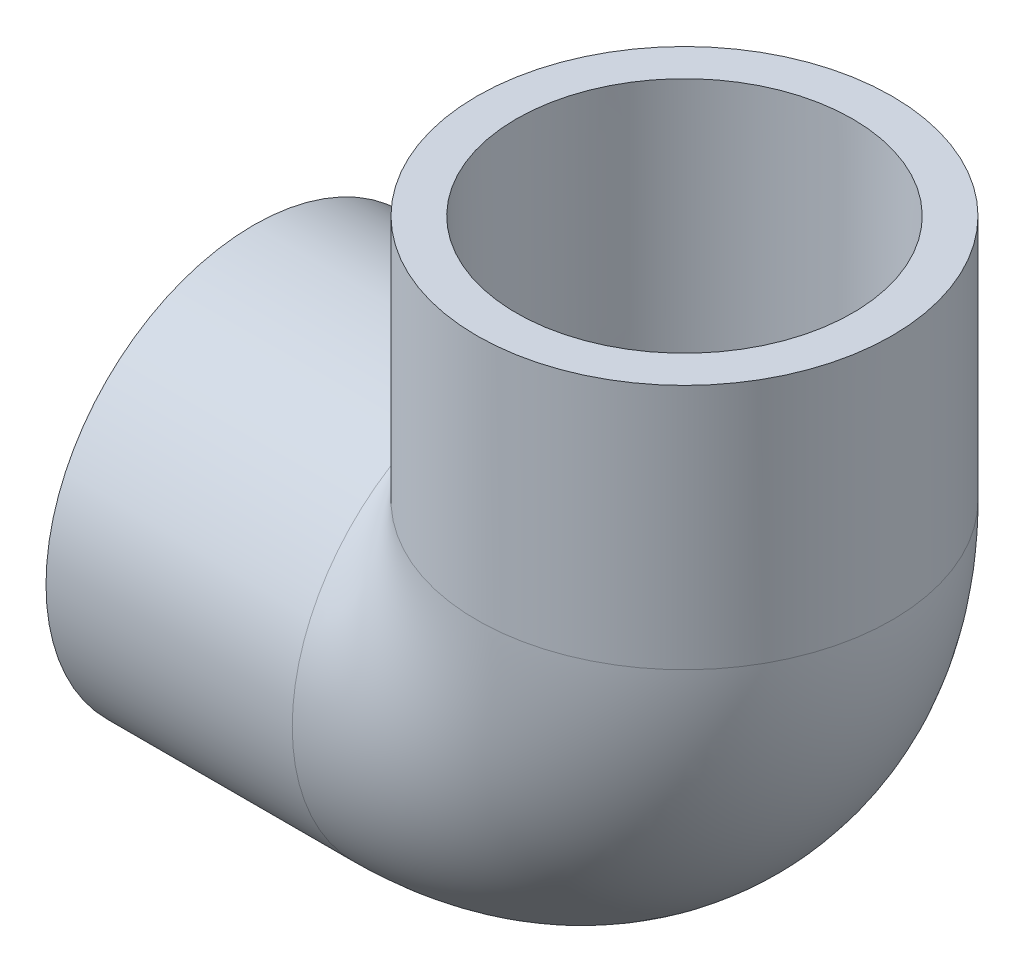
ISO-10303-21;
HEADER;
FILE_DESCRIPTION(('STEP AP214'),'2;1');
FILE_NAME('part.step','',(''),(''),'','','');
FILE_SCHEMA(('AUTOMOTIVE_DESIGN { 1 0 10303 214 1 1 1 1 }'));
ENDSEC;
DATA;
#1=APPLICATION_CONTEXT('core data for automotive mechanical design processes');
#2=APPLICATION_PROTOCOL_DEFINITION('international standard','automotive_design',2000,#1);
#3=PRODUCT_CONTEXT('',#1,'mechanical');
#4=PRODUCT('Part','Part','',(#3));
#5=PRODUCT_RELATED_PRODUCT_CATEGORY('part','',(#4));
#6=PRODUCT_DEFINITION_FORMATION('','',#4);
#7=PRODUCT_DEFINITION_CONTEXT('part definition',#1,'design');
#8=PRODUCT_DEFINITION('design','',#6,#7);
#9=PRODUCT_DEFINITION_SHAPE('','',#8);
#10=(LENGTH_UNIT() NAMED_UNIT(*) SI_UNIT(.MILLI.,.METRE.));
#11=(NAMED_UNIT(*) PLANE_ANGLE_UNIT() SI_UNIT($,.RADIAN.));
#12=(NAMED_UNIT(*) SI_UNIT($,.STERADIAN.) SOLID_ANGLE_UNIT());
#13=UNCERTAINTY_MEASURE_WITH_UNIT(LENGTH_MEASURE(1.E-05),#10,'distance_accuracy_value','');
#14=(GEOMETRIC_REPRESENTATION_CONTEXT(3) GLOBAL_UNCERTAINTY_ASSIGNED_CONTEXT((#13)) GLOBAL_UNIT_ASSIGNED_CONTEXT((#10,
#11,#12)) REPRESENTATION_CONTEXT('',''));
#15=CARTESIAN_POINT('',(0.,0.,0.));
#16=DIRECTION('',(0.,0.,1.));
#17=DIRECTION('',(1.,0.,0.));
#18=AXIS2_PLACEMENT_3D('',#15,#16,#17);
#19=CARTESIAN_POINT('',(-53.82895,-25.92578,0.));
#20=DIRECTION('',(-1.,0.,0.));
#21=DIRECTION('',(0.,0.,1.));
#22=AXIS2_PLACEMENT_3D('',#19,#20,#21);
#23=PLANE('',#22);
#24=CARTESIAN_POINT('',(-53.82895,0.,0.));
#25=DIRECTION('',(-1.,0.,0.));
#26=DIRECTION('',(0.,0.,1.));
#27=AXIS2_PLACEMENT_3D('',#24,#25,#26);
#28=CIRCLE('',#27,25.92578);
#29=CARTESIAN_POINT('',(-53.82895,0.,25.92578));
#30=VERTEX_POINT('',#29);
#31=EDGE_CURVE('E58',#30,#30,#28,.T.);
#32=ORIENTED_EDGE('',*,*,#31,.T.);
#33=EDGE_LOOP('',(#32));
#34=FACE_BOUND('',#33,.T.);
#35=CARTESIAN_POINT('',(-53.82895,0.,0.));
#36=DIRECTION('',(-1.,0.,0.));
#37=DIRECTION('',(0.,0.,1.));
#38=AXIS2_PLACEMENT_3D('',#35,#36,#37);
#39=CIRCLE('',#38,21.004276);
#40=CARTESIAN_POINT('',(-53.82895,0.,21.004276));
#41=VERTEX_POINT('',#40);
#42=EDGE_CURVE('E45',#41,#41,#39,.T.);
#43=ORIENTED_EDGE('',*,*,#42,.F.);
#44=EDGE_LOOP('',(#43));
#45=FACE_BOUND('',#44,.T.);
#46=ADVANCED_FACE('F38',(#34,#45),#23,.T.);
#47=CARTESIAN_POINT('',(-23.06955,0.,0.));
#48=DIRECTION('',(-1.,0.,0.));
#49=DIRECTION('',(0.,0.,1.));
#50=AXIS2_PLACEMENT_3D('',#47,#48,#49);
#51=CONICAL_SURFACE('',#50,20.806537,0.00642848287391597);
#52=ORIENTED_EDGE('',*,*,#42,.T.);
#53=EDGE_LOOP('',(#52));
#54=FACE_BOUND('',#53,.T.);
#55=CARTESIAN_POINT('',(-23.06955,0.,0.));
#56=DIRECTION('',(-1.,0.,0.));
#57=DIRECTION('',(0.,0.,1.));
#58=AXIS2_PLACEMENT_3D('',#55,#56,#57);
#59=CIRCLE('',#58,20.806537);
#60=CARTESIAN_POINT('',(-23.06955,0.,20.806537));
#61=VERTEX_POINT('',#60);
#62=EDGE_CURVE('E69',#61,#61,#59,.T.);
#63=ORIENTED_EDGE('',*,*,#62,.F.);
#64=EDGE_LOOP('',(#63));
#65=FACE_BOUND('',#64,.T.);
#66=ADVANCED_FACE('F78',(#54,#65),#51,.F.);
#67=CARTESIAN_POINT('',(-53.82895,0.,0.));
#68=DIRECTION('',(-1.,0.,0.));
#69=DIRECTION('',(0.,0.,1.));
#70=AXIS2_PLACEMENT_3D('',#67,#68,#69);
#71=CYLINDRICAL_SURFACE('',#70,25.92578);
#72=CARTESIAN_POINT('',(0.,0.,0.));
#73=DIRECTION('',(-0.707106781186547,-0.707106781186547,0.));
#74=DIRECTION('',(-0.707106781186547,0.707106781186547,0.));
#75=AXIS2_PLACEMENT_3D('',#72,#73,#74);
#76=ELLIPSE('',#75,36.6645896911011,25.92578);
#77=CARTESIAN_POINT('',(-23.06955,23.06955,-11.8297054657291));
#78=VERTEX_POINT('',#77);
#79=CARTESIAN_POINT('',(-23.06955,23.06955,11.829705465729));
#80=VERTEX_POINT('',#79);
#81=EDGE_CURVE('E57',#78,#80,#76,.F.);
#82=ORIENTED_EDGE('',*,*,#81,.F.);
#83=CARTESIAN_POINT('',(-23.06955,0.,0.));
#84=DIRECTION('',(-1.,0.,0.));
#85=DIRECTION('',(0.,0.,1.));
#86=AXIS2_PLACEMENT_3D('',#83,#84,#85);
#87=CIRCLE('',#86,25.92578);
#88=EDGE_CURVE('E64',#78,#80,#87,.T.);
#89=ORIENTED_EDGE('',*,*,#88,.T.);
#90=EDGE_LOOP('',(#82,#89));
#91=FACE_BOUND('',#90,.T.);
#92=ORIENTED_EDGE('',*,*,#31,.F.);
#93=EDGE_LOOP('',(#92));
#94=FACE_BOUND('',#93,.T.);
#95=ADVANCED_FACE('F62',(#91,#94),#71,.T.);
#96=CARTESIAN_POINT('',(-23.06955,23.06955,0.));
#97=DIRECTION('',(0.,0.,-1.));
#98=DIRECTION('',(-1.,0.,0.));
#99=AXIS2_PLACEMENT_3D('',#96,#97,#98);
#100=TOROIDAL_SURFACE('',#99,23.06955,16.47825);
#101=CARTESIAN_POINT('',(0.,23.06955,0.));
#102=DIRECTION('',(0.,1.,0.));
#103=DIRECTION('',(0.,0.,-1.));
#104=AXIS2_PLACEMENT_3D('',#101,#102,#103);
#105=CIRCLE('',#104,16.47825);
#106=CARTESIAN_POINT('',(16.47825,23.06955,0.));
#107=VERTEX_POINT('',#106);
#108=EDGE_CURVE('E59',#107,#107,#105,.T.);
#109=CARTESIAN_POINT('',(-23.06955,0.,0.));
#110=DIRECTION('',(1.,0.,0.));
#111=DIRECTION('',(0.,0.,-1.));
#112=AXIS2_PLACEMENT_3D('',#109,#110,#111);
#113=CIRCLE('',#112,16.47825);
#114=CARTESIAN_POINT('',(-23.06955,-16.47825,0.));
#115=VERTEX_POINT('',#114);
#116=EDGE_CURVE('E65',#115,#115,#113,.T.);
#117=CARTESIAN_POINT('',(-23.06955,23.06955,0.));
#118=DIRECTION('',(0.,0.,-1.));
#119=DIRECTION('',(-1.,0.,0.));
#120=AXIS2_PLACEMENT_3D('',#117,#118,#119);
#121=CIRCLE('',#120,39.5478);
#122=EDGE_CURVE('',#107,#115,#121,.T.);
#123=ORIENTED_EDGE('',*,*,#108,.T.);
#124=ORIENTED_EDGE('',*,*,#116,.F.);
#125=ORIENTED_EDGE('',*,*,#122,.T.);
#126=ORIENTED_EDGE('',*,*,#122,.F.);
#127=EDGE_LOOP('',(#123,#125,#124,#126));
#128=FACE_BOUND('',#127,.T.);
#129=ADVANCED_FACE('F88',(#128),#100,.F.);
#130=CARTESIAN_POINT('',(-46.1391,23.06955,0.));
#131=DIRECTION('',(0.,-1.,0.));
#132=DIRECTION('',(-1.,0.,0.));
#133=AXIS2_PLACEMENT_3D('',#130,#131,#132);
#134=CIRCLE('',#133,25.92578);
#135=TRIMMED_CURVE('',#134,(PARAMETER_VALUE(-2.66776990694721)),
(PARAMETER_VALUE(2.66776990694721)),.T.,.PARAMETER.);
#136=CARTESIAN_POINT('',(-23.06955,23.06955,0.));
#137=DIRECTION('',(0.,0.,-1.));
#138=AXIS1_PLACEMENT('',#136,#137);
#139=SURFACE_OF_REVOLUTION('',#135,#138);
#140=CARTESIAN_POINT('',(0.,23.06955,0.));
#141=DIRECTION('',(0.,1.,0.));
#142=DIRECTION('',(0.,0.,-1.));
#143=AXIS2_PLACEMENT_3D('',#140,#141,#142);
#144=CIRCLE('',#143,25.92578);
#145=EDGE_CURVE('E51',#80,#78,#144,.T.);
#146=ORIENTED_EDGE('',*,*,#145,.F.);
#147=ORIENTED_EDGE('',*,*,#88,.F.);
#148=EDGE_LOOP('',(#146,#147));
#149=FACE_BOUND('',#148,.T.);
#150=ADVANCED_FACE('F68',(#149),#139,.T.);
#151=CARTESIAN_POINT('',(0.,23.06955,0.));
#152=DIRECTION('',(0.,1.,0.));
#153=DIRECTION('',(0.,0.,-1.));
#154=AXIS2_PLACEMENT_3D('',#151,#152,#153);
#155=PLANE('',#154);
#156=CARTESIAN_POINT('',(0.,23.06955,0.));
#157=DIRECTION('',(0.,1.,0.));
#158=DIRECTION('',(-1.,0.,0.));
#159=AXIS2_PLACEMENT_3D('',#156,#157,#158);
#160=CIRCLE('',#159,20.806537);
#161=CARTESIAN_POINT('',(-20.806537,23.06955,0.));
#162=VERTEX_POINT('',#161);
#163=EDGE_CURVE('E11',#162,#162,#160,.F.);
#164=ORIENTED_EDGE('',*,*,#163,.F.);
#165=EDGE_LOOP('',(#164));
#166=FACE_BOUND('',#165,.T.);
#167=ORIENTED_EDGE('',*,*,#108,.F.);
#168=EDGE_LOOP('',(#167));
#169=FACE_BOUND('',#168,.T.);
#170=ADVANCED_FACE('F95',(#166,#169),#155,.T.);
#171=CARTESIAN_POINT('',(-23.06955,0.,0.));
#172=DIRECTION('',(1.,0.,0.));
#173=DIRECTION('',(0.,0.,-1.));
#174=AXIS2_PLACEMENT_3D('',#171,#172,#173);
#175=PLANE('',#174);
#176=ORIENTED_EDGE('',*,*,#62,.T.);
#177=EDGE_LOOP('',(#176));
#178=FACE_BOUND('',#177,.T.);
#179=ORIENTED_EDGE('',*,*,#116,.T.);
#180=EDGE_LOOP('',(#179));
#181=FACE_BOUND('',#180,.T.);
#182=ADVANCED_FACE('F98',(#178,#181),#175,.F.);
#183=CARTESIAN_POINT('',(25.92578,53.82895,0.));
#184=DIRECTION('',(0.,1.,0.));
#185=DIRECTION('',(0.,0.,1.));
#186=AXIS2_PLACEMENT_3D('',#183,#184,#185);
#187=PLANE('',#186);
#188=CARTESIAN_POINT('',(0.,53.82895,0.));
#189=DIRECTION('',(0.,-1.,0.));
#190=DIRECTION('',(0.,0.,-1.));
#191=AXIS2_PLACEMENT_3D('',#188,#189,#190);
#192=CIRCLE('',#191,21.004276);
#193=CARTESIAN_POINT('',(0.,53.82895,-21.004276));
#194=VERTEX_POINT('',#193);
#195=EDGE_CURVE('E122',#194,#194,#192,.T.);
#196=ORIENTED_EDGE('',*,*,#195,.T.);
#197=EDGE_LOOP('',(#196));
#198=FACE_BOUND('',#197,.T.);
#199=CARTESIAN_POINT('',(0.,53.82895,0.));
#200=DIRECTION('',(0.,-1.,0.));
#201=DIRECTION('',(0.,0.,-1.));
#202=AXIS2_PLACEMENT_3D('',#199,#200,#201);
#203=CIRCLE('',#202,25.92578);
#204=CARTESIAN_POINT('',(0.,53.82895,-25.92578));
#205=VERTEX_POINT('',#204);
#206=EDGE_CURVE('E66',#205,#205,#203,.T.);
#207=ORIENTED_EDGE('',*,*,#206,.F.);
#208=EDGE_LOOP('',(#207));
#209=FACE_BOUND('',#208,.T.);
#210=ADVANCED_FACE('F105',(#198,#209),#187,.T.);
#211=CARTESIAN_POINT('',(0.,0.,0.));
#212=DIRECTION('',(0.,-1.,0.));
#213=DIRECTION('',(0.,0.,-1.));
#214=AXIS2_PLACEMENT_3D('',#211,#212,#213);
#215=CYLINDRICAL_SURFACE('',#214,25.92578);
#216=ORIENTED_EDGE('',*,*,#206,.T.);
#217=EDGE_LOOP('',(#216));
#218=FACE_BOUND('',#217,.T.);
#219=ORIENTED_EDGE('',*,*,#145,.T.);
#220=ORIENTED_EDGE('',*,*,#81,.T.);
#221=EDGE_LOOP('',(#219,#220));
#222=FACE_BOUND('',#221,.T.);
#223=ADVANCED_FACE('F56',(#218,#222),#215,.T.);
#224=CARTESIAN_POINT('',(0.,53.82895,0.));
#225=DIRECTION('',(0.,1.,0.));
#226=DIRECTION('',(0.,0.,1.));
#227=AXIS2_PLACEMENT_3D('',#224,#225,#226);
#228=CONICAL_SURFACE('',#227,21.004276,0.00642848287391597);
#229=ORIENTED_EDGE('',*,*,#163,.T.);
#230=EDGE_LOOP('',(#229));
#231=FACE_BOUND('',#230,.T.);
#232=ORIENTED_EDGE('',*,*,#195,.F.);
#233=EDGE_LOOP('',(#232));
#234=FACE_BOUND('',#233,.T.);
#235=ADVANCED_FACE('F112',(#231,#234),#228,.F.);
#236=CLOSED_SHELL('',(#46,#66,#95,#129,#150,#170,#182,#210,#223,#235));
#237=MANIFOLD_SOLID_BREP('B2',#236);
#238=ADVANCED_BREP_SHAPE_REPRESENTATION('',(#18,#237),#14);
#239=SHAPE_DEFINITION_REPRESENTATION(#9,#238);
ENDSEC;
END-ISO-10303-21;
